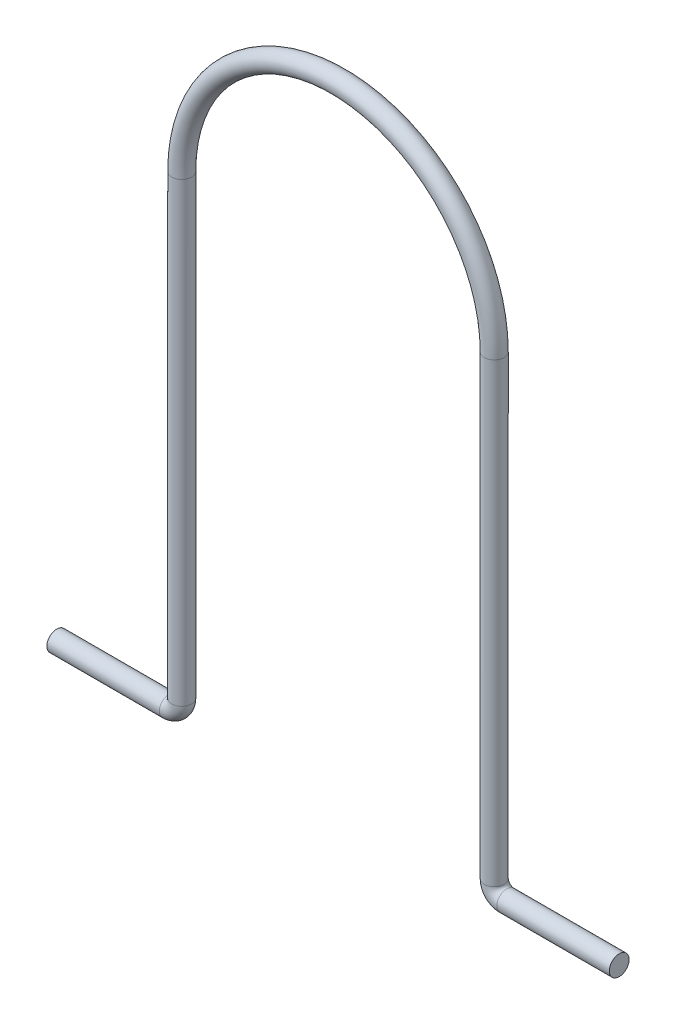
ISO-10303-21;
HEADER;
FILE_DESCRIPTION(('STEP AP214'),'2;1');
FILE_NAME('part.step','',(''),(''),'','','');
FILE_SCHEMA(('AUTOMOTIVE_DESIGN { 1 0 10303 214 1 1 1 1 }'));
ENDSEC;
DATA;
#1=APPLICATION_CONTEXT('core data for automotive mechanical design processes');
#2=APPLICATION_PROTOCOL_DEFINITION('international standard','automotive_design',2000,#1);
#3=PRODUCT_CONTEXT('',#1,'mechanical');
#4=PRODUCT('Part','Part','',(#3));
#5=PRODUCT_RELATED_PRODUCT_CATEGORY('part','',(#4));
#6=PRODUCT_DEFINITION_FORMATION('','',#4);
#7=PRODUCT_DEFINITION_CONTEXT('part definition',#1,'design');
#8=PRODUCT_DEFINITION('design','',#6,#7);
#9=PRODUCT_DEFINITION_SHAPE('','',#8);
#10=(LENGTH_UNIT() NAMED_UNIT(*) SI_UNIT(.MILLI.,.METRE.));
#11=(NAMED_UNIT(*) PLANE_ANGLE_UNIT() SI_UNIT($,.RADIAN.));
#12=(NAMED_UNIT(*) SI_UNIT($,.STERADIAN.) SOLID_ANGLE_UNIT());
#13=UNCERTAINTY_MEASURE_WITH_UNIT(LENGTH_MEASURE(1.E-05),#10,'distance_accuracy_value','');
#14=(GEOMETRIC_REPRESENTATION_CONTEXT(3) GLOBAL_UNCERTAINTY_ASSIGNED_CONTEXT((#13)) GLOBAL_UNIT_ASSIGNED_CONTEXT((#10,
#11,#12)) REPRESENTATION_CONTEXT('',''));
#15=CARTESIAN_POINT('',(0.,0.,0.));
#16=DIRECTION('',(0.,0.,1.));
#17=DIRECTION('',(1.,0.,0.));
#18=AXIS2_PLACEMENT_3D('',#15,#16,#17);
#19=CARTESIAN_POINT('',(72.,0.,0.));
#20=DIRECTION('',(1.,0.,0.));
#21=DIRECTION('',(0.,0.,-1.));
#22=AXIS2_PLACEMENT_3D('',#19,#20,#21);
#23=CYLINDRICAL_SURFACE('',#22,1.5875);
#24=CARTESIAN_POINT('',(72.,0.,0.));
#25=DIRECTION('',(1.,0.,0.));
#26=DIRECTION('',(0.,0.,-1.));
#27=AXIS2_PLACEMENT_3D('',#24,#25,#26);
#28=CIRCLE('',#27,1.5875);
#29=CARTESIAN_POINT('',(72.,-1.58750000000001,0.));
#30=VERTEX_POINT('',#29);
#31=EDGE_CURVE('E37',#30,#30,#28,.T.);
#32=ORIENTED_EDGE('',*,*,#31,.T.);
#33=EDGE_LOOP('',(#32));
#34=FACE_BOUND('',#33,.T.);
#35=CARTESIAN_POINT('',(90.,0.,0.));
#36=DIRECTION('',(1.,0.,0.));
#37=DIRECTION('',(0.,0.,-1.));
#38=AXIS2_PLACEMENT_3D('',#35,#36,#37);
#39=CIRCLE('',#38,1.5875);
#40=CARTESIAN_POINT('',(90.,0.,-1.5875));
#41=VERTEX_POINT('',#40);
#42=EDGE_CURVE('E10',#41,#41,#39,.T.);
#43=ORIENTED_EDGE('',*,*,#42,.F.);
#44=EDGE_LOOP('',(#43));
#45=FACE_BOUND('',#44,.T.);
#46=ADVANCED_FACE('F31',(#34,#45),#23,.T.);
#47=CARTESIAN_POINT('',(72.,2.,0.));
#48=DIRECTION('',(0.,0.,1.));
#49=DIRECTION('',(1.,0.,0.));
#50=AXIS2_PLACEMENT_3D('',#47,#48,#49);
#51=TOROIDAL_SURFACE('',#50,2.00000000000002,1.5875);
#52=CARTESIAN_POINT('',(70.,2.,0.));
#53=DIRECTION('',(0.,-1.,0.));
#54=DIRECTION('',(0.,0.,-1.));
#55=AXIS2_PLACEMENT_3D('',#52,#53,#54);
#56=CIRCLE('',#55,1.5875);
#57=CARTESIAN_POINT('',(68.4125,2.,0.));
#58=VERTEX_POINT('',#57);
#59=EDGE_CURVE('E41',#58,#58,#56,.T.);
#60=CARTESIAN_POINT('',(72.,2.,0.));
#61=DIRECTION('',(0.,0.,1.));
#62=DIRECTION('',(1.,0.,0.));
#63=AXIS2_PLACEMENT_3D('',#60,#61,#62);
#64=CIRCLE('',#63,3.58750000000002);
#65=EDGE_CURVE('',#58,#30,#64,.T.);
#66=ORIENTED_EDGE('',*,*,#59,.T.);
#67=ORIENTED_EDGE('',*,*,#31,.F.);
#68=ORIENTED_EDGE('',*,*,#65,.T.);
#69=ORIENTED_EDGE('',*,*,#65,.F.);
#70=EDGE_LOOP('',(#66,#68,#67,#69));
#71=FACE_BOUND('',#70,.T.);
#72=ADVANCED_FACE('F81',(#71),#51,.T.);
#73=CARTESIAN_POINT('',(70.,75.,0.));
#74=DIRECTION('',(0.,-1.,0.));
#75=DIRECTION('',(1.,0.,0.));
#76=AXIS2_PLACEMENT_3D('',#73,#74,#75);
#77=CYLINDRICAL_SURFACE('',#76,1.5875);
#78=CARTESIAN_POINT('',(70.,75.,0.));
#79=DIRECTION('',(0.,-1.,0.));
#80=DIRECTION('',(0.,0.,-1.));
#81=AXIS2_PLACEMENT_3D('',#78,#79,#80);
#82=CIRCLE('',#81,1.5875);
#83=CARTESIAN_POINT('',(71.5875,75.,0.));
#84=VERTEX_POINT('',#83);
#85=EDGE_CURVE('E45',#84,#84,#82,.T.);
#86=ORIENTED_EDGE('',*,*,#85,.T.);
#87=EDGE_LOOP('',(#86));
#88=FACE_BOUND('',#87,.T.);
#89=ORIENTED_EDGE('',*,*,#59,.F.);
#90=EDGE_LOOP('',(#89));
#91=FACE_BOUND('',#90,.T.);
#92=ADVANCED_FACE('F85',(#88,#91),#77,.T.);
#93=CARTESIAN_POINT('',(45.,75.,0.));
#94=DIRECTION('',(0.,0.,-1.));
#95=DIRECTION('',(-1.,0.,0.));
#96=AXIS2_PLACEMENT_3D('',#93,#94,#95);
#97=TOROIDAL_SURFACE('',#96,25.,1.5875);
#98=CARTESIAN_POINT('',(20.,75.,0.));
#99=DIRECTION('',(0.,1.,0.));
#100=DIRECTION('',(0.,0.,-1.));
#101=AXIS2_PLACEMENT_3D('',#98,#99,#100);
#102=CIRCLE('',#101,1.5875);
#103=CARTESIAN_POINT('',(18.4125,75.,0.));
#104=VERTEX_POINT('',#103);
#105=EDGE_CURVE('E50',#104,#104,#102,.T.);
#106=CARTESIAN_POINT('',(45.,75.,0.));
#107=DIRECTION('',(0.,0.,-1.));
#108=DIRECTION('',(-1.,0.,0.));
#109=AXIS2_PLACEMENT_3D('',#106,#107,#108);
#110=CIRCLE('',#109,26.5875);
#111=EDGE_CURVE('',#104,#84,#110,.T.);
#112=ORIENTED_EDGE('',*,*,#105,.T.);
#113=ORIENTED_EDGE('',*,*,#85,.F.);
#114=ORIENTED_EDGE('',*,*,#111,.T.);
#115=ORIENTED_EDGE('',*,*,#111,.F.);
#116=EDGE_LOOP('',(#112,#114,#113,#115));
#117=FACE_BOUND('',#116,.T.);
#118=ADVANCED_FACE('F91',(#117),#97,.T.);
#119=CARTESIAN_POINT('',(20.,2.,0.));
#120=DIRECTION('',(0.,1.,0.));
#121=DIRECTION('',(0.,0.,1.));
#122=AXIS2_PLACEMENT_3D('',#119,#120,#121);
#123=CYLINDRICAL_SURFACE('',#122,1.5875);
#124=CARTESIAN_POINT('',(20.,2.,0.));
#125=DIRECTION('',(0.,1.,0.));
#126=DIRECTION('',(0.,0.,-1.));
#127=AXIS2_PLACEMENT_3D('',#124,#125,#126);
#128=CIRCLE('',#127,1.5875);
#129=CARTESIAN_POINT('',(21.5875,2.,0.));
#130=VERTEX_POINT('',#129);
#131=EDGE_CURVE('E53',#130,#130,#128,.T.);
#132=ORIENTED_EDGE('',*,*,#131,.T.);
#133=EDGE_LOOP('',(#132));
#134=FACE_BOUND('',#133,.T.);
#135=ORIENTED_EDGE('',*,*,#105,.F.);
#136=EDGE_LOOP('',(#135));
#137=FACE_BOUND('',#136,.T.);
#138=ADVANCED_FACE('F98',(#134,#137),#123,.T.);
#139=CARTESIAN_POINT('',(18.,2.,0.));
#140=DIRECTION('',(0.,0.,1.));
#141=DIRECTION('',(1.,0.,0.));
#142=AXIS2_PLACEMENT_3D('',#139,#140,#141);
#143=TOROIDAL_SURFACE('',#142,2.,1.5875);
#144=CARTESIAN_POINT('',(18.,0.,0.));
#145=DIRECTION('',(1.,0.,0.));
#146=DIRECTION('',(0.,0.,-1.));
#147=AXIS2_PLACEMENT_3D('',#144,#145,#146);
#148=CIRCLE('',#147,1.5875);
#149=CARTESIAN_POINT('',(18.,-1.5875,0.));
#150=VERTEX_POINT('',#149);
#151=EDGE_CURVE('E56',#150,#150,#148,.T.);
#152=CARTESIAN_POINT('',(18.,2.,0.));
#153=DIRECTION('',(0.,0.,1.));
#154=DIRECTION('',(1.,0.,0.));
#155=AXIS2_PLACEMENT_3D('',#152,#153,#154);
#156=CIRCLE('',#155,3.5875);
#157=EDGE_CURVE('',#150,#130,#156,.T.);
#158=ORIENTED_EDGE('',*,*,#151,.T.);
#159=ORIENTED_EDGE('',*,*,#131,.F.);
#160=ORIENTED_EDGE('',*,*,#157,.T.);
#161=ORIENTED_EDGE('',*,*,#157,.F.);
#162=EDGE_LOOP('',(#158,#160,#159,#161));
#163=FACE_BOUND('',#162,.T.);
#164=ADVANCED_FACE('F63',(#163),#143,.T.);
#165=CARTESIAN_POINT('',(18.,0.,0.));
#166=DIRECTION('',(-1.,0.,0.));
#167=DIRECTION('',(0.,0.,1.));
#168=AXIS2_PLACEMENT_3D('',#165,#166,#167);
#169=CYLINDRICAL_SURFACE('',#168,1.5875);
#170=ORIENTED_EDGE('',*,*,#151,.F.);
#171=EDGE_LOOP('',(#170));
#172=FACE_BOUND('',#171,.T.);
#173=CARTESIAN_POINT('',(0.,0.,0.));
#174=DIRECTION('',(1.,0.,0.));
#175=DIRECTION('',(0.,0.,-1.));
#176=AXIS2_PLACEMENT_3D('',#173,#174,#175);
#177=CIRCLE('',#176,1.5875);
#178=CARTESIAN_POINT('',(0.,0.,-1.5875));
#179=VERTEX_POINT('',#178);
#180=EDGE_CURVE('E57',#179,#179,#177,.T.);
#181=ORIENTED_EDGE('',*,*,#180,.T.);
#182=EDGE_LOOP('',(#181));
#183=FACE_BOUND('',#182,.T.);
#184=ADVANCED_FACE('F66',(#172,#183),#169,.T.);
#185=CARTESIAN_POINT('',(90.,0.,0.));
#186=DIRECTION('',(1.,0.,0.));
#187=DIRECTION('',(0.,0.,-1.));
#188=AXIS2_PLACEMENT_3D('',#185,#186,#187);
#189=PLANE('',#188);
#190=ORIENTED_EDGE('',*,*,#42,.T.);
#191=EDGE_LOOP('',(#190));
#192=FACE_BOUND('',#191,.T.);
#193=ADVANCED_FACE('F69',(#192),#189,.T.);
#194=CARTESIAN_POINT('',(0.,0.,0.));
#195=DIRECTION('',(1.,0.,0.));
#196=DIRECTION('',(0.,0.,-1.));
#197=AXIS2_PLACEMENT_3D('',#194,#195,#196);
#198=PLANE('',#197);
#199=ORIENTED_EDGE('',*,*,#180,.F.);
#200=EDGE_LOOP('',(#199));
#201=FACE_BOUND('',#200,.T.);
#202=ADVANCED_FACE('F73',(#201),#198,.F.);
#203=CLOSED_SHELL('',(#46,#72,#92,#118,#138,#164,#184,#193,#202));
#204=MANIFOLD_SOLID_BREP('B2',#203);
#205=ADVANCED_BREP_SHAPE_REPRESENTATION('',(#18,#204),#14);
#206=SHAPE_DEFINITION_REPRESENTATION(#9,#205);
ENDSEC;
END-ISO-10303-21;
